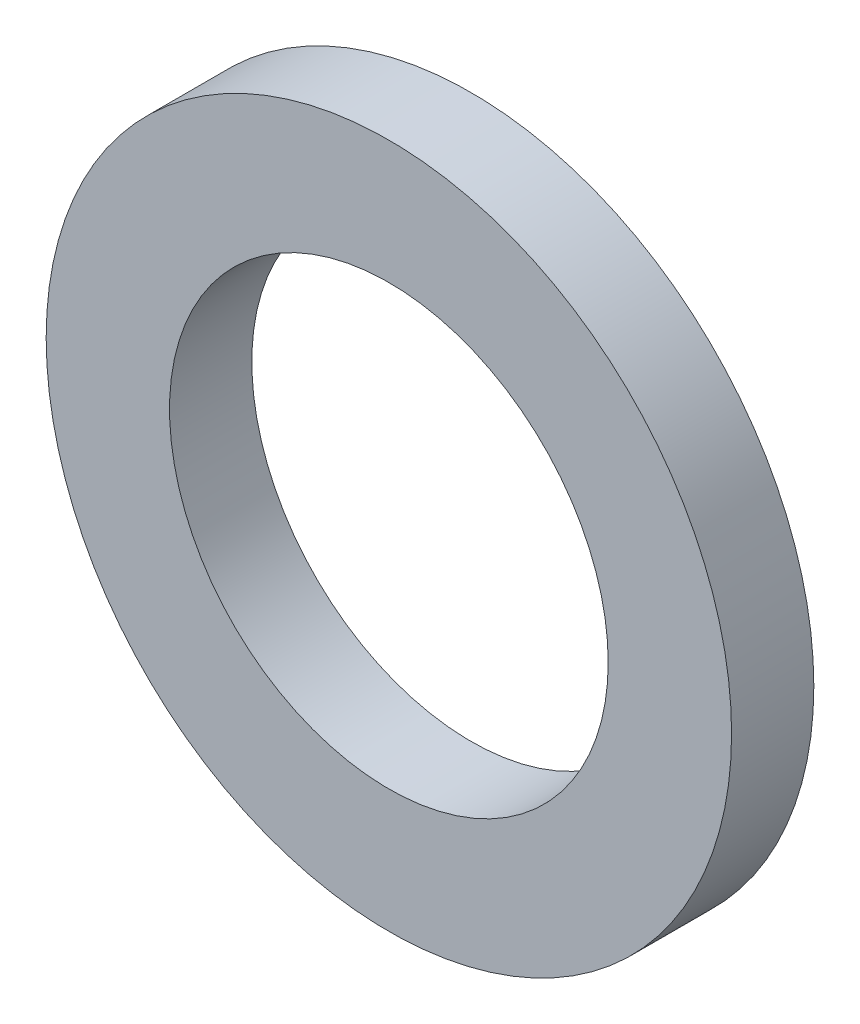
ISO-10303-21;
HEADER;
FILE_DESCRIPTION(('STEP AP214'),'2;1');
FILE_NAME('part.step','',(''),(''),'','','');
FILE_SCHEMA(('AUTOMOTIVE_DESIGN { 1 0 10303 214 1 1 1 1 }'));
ENDSEC;
DATA;
#1=APPLICATION_CONTEXT('core data for automotive mechanical design processes');
#2=APPLICATION_PROTOCOL_DEFINITION('international standard','automotive_design',2000,#1);
#3=PRODUCT_CONTEXT('',#1,'mechanical');
#4=PRODUCT('Part','Part','',(#3));
#5=PRODUCT_RELATED_PRODUCT_CATEGORY('part','',(#4));
#6=PRODUCT_DEFINITION_FORMATION('','',#4);
#7=PRODUCT_DEFINITION_CONTEXT('part definition',#1,'design');
#8=PRODUCT_DEFINITION('design','',#6,#7);
#9=PRODUCT_DEFINITION_SHAPE('','',#8);
#10=(LENGTH_UNIT() NAMED_UNIT(*) SI_UNIT(.MILLI.,.METRE.));
#11=(NAMED_UNIT(*) PLANE_ANGLE_UNIT() SI_UNIT($,.RADIAN.));
#12=(NAMED_UNIT(*) SI_UNIT($,.STERADIAN.) SOLID_ANGLE_UNIT());
#13=UNCERTAINTY_MEASURE_WITH_UNIT(LENGTH_MEASURE(1.E-05),#10,'distance_accuracy_value','');
#14=(GEOMETRIC_REPRESENTATION_CONTEXT(3) GLOBAL_UNCERTAINTY_ASSIGNED_CONTEXT((#13)) GLOBAL_UNIT_ASSIGNED_CONTEXT((#10,
#11,#12)) REPRESENTATION_CONTEXT('',''));
#15=CARTESIAN_POINT('',(0.,0.,0.));
#16=DIRECTION('',(0.,0.,1.));
#17=DIRECTION('',(1.,0.,0.));
#18=AXIS2_PLACEMENT_3D('',#15,#16,#17);
#19=CARTESIAN_POINT('',(0.,0.,1.5));
#20=DIRECTION('',(0.,0.,1.));
#21=DIRECTION('',(1.,0.,0.));
#22=AXIS2_PLACEMENT_3D('',#19,#20,#21);
#23=PLANE('',#22);
#24=CARTESIAN_POINT('',(0.,0.,1.5));
#25=DIRECTION('',(0.,0.,1.));
#26=DIRECTION('',(1.,0.,0.));
#27=AXIS2_PLACEMENT_3D('',#24,#25,#26);
#28=CIRCLE('',#27,6.25);
#29=CARTESIAN_POINT('',(6.25,0.,1.5));
#30=VERTEX_POINT('',#29);
#31=EDGE_CURVE('E10',#30,#30,#28,.T.);
#32=ORIENTED_EDGE('',*,*,#31,.T.);
#33=EDGE_LOOP('',(#32));
#34=FACE_BOUND('',#33,.T.);
#35=CARTESIAN_POINT('',(0.,0.,1.5));
#36=DIRECTION('',(0.,0.,1.));
#37=DIRECTION('',(1.,0.,0.));
#38=AXIS2_PLACEMENT_3D('',#35,#36,#37);
#39=CIRCLE('',#38,4.);
#40=CARTESIAN_POINT('',(4.,0.,1.5));
#41=VERTEX_POINT('',#40);
#42=EDGE_CURVE('E42',#41,#41,#39,.T.);
#43=ORIENTED_EDGE('',*,*,#42,.F.);
#44=EDGE_LOOP('',(#43));
#45=FACE_BOUND('',#44,.T.);
#46=ADVANCED_FACE('F31',(#34,#45),#23,.T.);
#47=CARTESIAN_POINT('',(0.,0.,0.));
#48=DIRECTION('',(0.,0.,1.));
#49=DIRECTION('',(1.,0.,0.));
#50=AXIS2_PLACEMENT_3D('',#47,#48,#49);
#51=PLANE('',#50);
#52=CARTESIAN_POINT('',(0.,0.,0.));
#53=DIRECTION('',(0.,0.,1.));
#54=DIRECTION('',(1.,0.,0.));
#55=AXIS2_PLACEMENT_3D('',#52,#53,#54);
#56=CIRCLE('',#55,6.25);
#57=CARTESIAN_POINT('',(6.25,0.,0.));
#58=VERTEX_POINT('',#57);
#59=EDGE_CURVE('E35',#58,#58,#56,.T.);
#60=ORIENTED_EDGE('',*,*,#59,.F.);
#61=EDGE_LOOP('',(#60));
#62=FACE_BOUND('',#61,.T.);
#63=CARTESIAN_POINT('',(0.,0.,0.));
#64=DIRECTION('',(0.,0.,1.));
#65=DIRECTION('',(1.,0.,0.));
#66=AXIS2_PLACEMENT_3D('',#63,#64,#65);
#67=CIRCLE('',#66,4.);
#68=CARTESIAN_POINT('',(4.,0.,0.));
#69=VERTEX_POINT('',#68);
#70=EDGE_CURVE('E44',#69,#69,#67,.T.);
#71=ORIENTED_EDGE('',*,*,#70,.T.);
#72=EDGE_LOOP('',(#71));
#73=FACE_BOUND('',#72,.T.);
#74=ADVANCED_FACE('F54',(#62,#73),#51,.F.);
#75=CARTESIAN_POINT('',(0.,0.,1.5));
#76=DIRECTION('',(0.,0.,-1.));
#77=DIRECTION('',(-1.,0.,0.));
#78=AXIS2_PLACEMENT_3D('',#75,#76,#77);
#79=CYLINDRICAL_SURFACE('',#78,6.25);
#80=ORIENTED_EDGE('',*,*,#31,.F.);
#81=EDGE_LOOP('',(#80));
#82=FACE_BOUND('',#81,.T.);
#83=ORIENTED_EDGE('',*,*,#59,.T.);
#84=EDGE_LOOP('',(#83));
#85=FACE_BOUND('',#84,.T.);
#86=ADVANCED_FACE('F33',(#82,#85),#79,.T.);
#87=CARTESIAN_POINT('',(0.,0.,1.5));
#88=DIRECTION('',(0.,0.,-1.));
#89=DIRECTION('',(-1.,0.,0.));
#90=AXIS2_PLACEMENT_3D('',#87,#88,#89);
#91=CYLINDRICAL_SURFACE('',#90,4.);
#92=ORIENTED_EDGE('',*,*,#42,.T.);
#93=EDGE_LOOP('',(#92));
#94=FACE_BOUND('',#93,.T.);
#95=ORIENTED_EDGE('',*,*,#70,.F.);
#96=EDGE_LOOP('',(#95));
#97=FACE_BOUND('',#96,.T.);
#98=ADVANCED_FACE('F50',(#94,#97),#91,.F.);
#99=CLOSED_SHELL('',(#46,#74,#86,#98));
#100=MANIFOLD_SOLID_BREP('B2',#99);
#101=ADVANCED_BREP_SHAPE_REPRESENTATION('',(#18,#100),#14);
#102=SHAPE_DEFINITION_REPRESENTATION(#9,#101);
ENDSEC;
END-ISO-10303-21;
